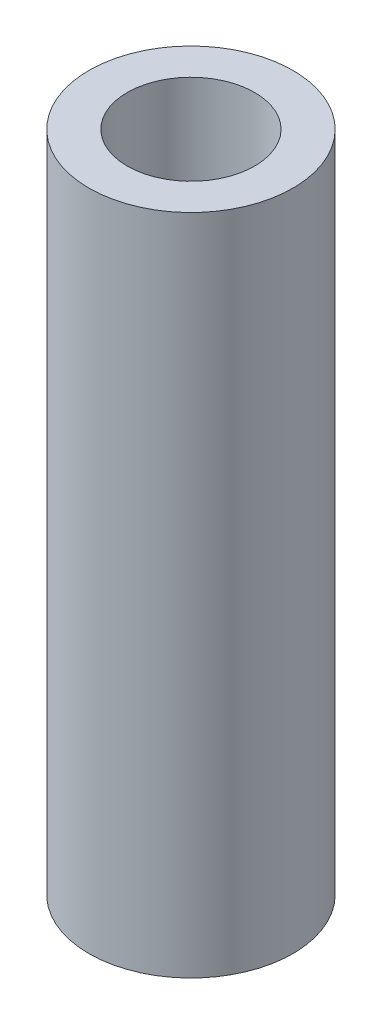
ISO-10303-21;
HEADER;
FILE_DESCRIPTION(('STEP AP214'),'2;1');
FILE_NAME('part.step','',(''),(''),'','','');
FILE_SCHEMA(('AUTOMOTIVE_DESIGN { 1 0 10303 214 1 1 1 1 }'));
ENDSEC;
DATA;
#1=APPLICATION_CONTEXT('core data for automotive mechanical design processes');
#2=APPLICATION_PROTOCOL_DEFINITION('international standard','automotive_design',2000,#1);
#3=PRODUCT_CONTEXT('',#1,'mechanical');
#4=PRODUCT('Part','Part','',(#3));
#5=PRODUCT_RELATED_PRODUCT_CATEGORY('part','',(#4));
#6=PRODUCT_DEFINITION_FORMATION('','',#4);
#7=PRODUCT_DEFINITION_CONTEXT('part definition',#1,'design');
#8=PRODUCT_DEFINITION('design','',#6,#7);
#9=PRODUCT_DEFINITION_SHAPE('','',#8);
#10=(LENGTH_UNIT() NAMED_UNIT(*) SI_UNIT(.MILLI.,.METRE.));
#11=(NAMED_UNIT(*) PLANE_ANGLE_UNIT() SI_UNIT($,.RADIAN.));
#12=(NAMED_UNIT(*) SI_UNIT($,.STERADIAN.) SOLID_ANGLE_UNIT());
#13=UNCERTAINTY_MEASURE_WITH_UNIT(LENGTH_MEASURE(1.E-05),#10,'distance_accuracy_value','');
#14=(GEOMETRIC_REPRESENTATION_CONTEXT(3) GLOBAL_UNCERTAINTY_ASSIGNED_CONTEXT((#13)) GLOBAL_UNIT_ASSIGNED_CONTEXT((#10,
#11,#12)) REPRESENTATION_CONTEXT('',''));
#15=CARTESIAN_POINT('',(0.,0.,0.));
#16=DIRECTION('',(0.,0.,1.));
#17=DIRECTION('',(1.,0.,0.));
#18=AXIS2_PLACEMENT_3D('',#15,#16,#17);
#19=CARTESIAN_POINT('',(0.,26.,0.));
#20=DIRECTION('',(0.,1.,0.));
#21=DIRECTION('',(0.,0.,1.));
#22=AXIS2_PLACEMENT_3D('',#19,#20,#21);
#23=PLANE('',#22);
#24=CARTESIAN_POINT('',(0.,26.,0.));
#25=DIRECTION('',(0.,1.,0.));
#26=DIRECTION('',(0.,0.,1.));
#27=AXIS2_PLACEMENT_3D('',#24,#25,#26);
#28=CIRCLE('',#27,4.);
#29=CARTESIAN_POINT('',(0.,26.,4.));
#30=VERTEX_POINT('',#29);
#31=EDGE_CURVE('E10',#30,#30,#28,.T.);
#32=ORIENTED_EDGE('',*,*,#31,.T.);
#33=EDGE_LOOP('',(#32));
#34=FACE_BOUND('',#33,.T.);
#35=CARTESIAN_POINT('',(0.,26.,0.));
#36=DIRECTION('',(0.,1.,0.));
#37=DIRECTION('',(0.,0.,1.));
#38=AXIS2_PLACEMENT_3D('',#35,#36,#37);
#39=CIRCLE('',#38,2.5);
#40=CARTESIAN_POINT('',(0.,26.,2.5));
#41=VERTEX_POINT('',#40);
#42=EDGE_CURVE('E42',#41,#41,#39,.T.);
#43=ORIENTED_EDGE('',*,*,#42,.F.);
#44=EDGE_LOOP('',(#43));
#45=FACE_BOUND('',#44,.T.);
#46=ADVANCED_FACE('F31',(#34,#45),#23,.T.);
#47=CARTESIAN_POINT('',(0.,0.,0.));
#48=DIRECTION('',(0.,1.,0.));
#49=DIRECTION('',(0.,0.,1.));
#50=AXIS2_PLACEMENT_3D('',#47,#48,#49);
#51=PLANE('',#50);
#52=CARTESIAN_POINT('',(0.,0.,0.));
#53=DIRECTION('',(0.,1.,0.));
#54=DIRECTION('',(0.,0.,1.));
#55=AXIS2_PLACEMENT_3D('',#52,#53,#54);
#56=CIRCLE('',#55,4.);
#57=CARTESIAN_POINT('',(0.,0.,4.));
#58=VERTEX_POINT('',#57);
#59=EDGE_CURVE('E35',#58,#58,#56,.T.);
#60=ORIENTED_EDGE('',*,*,#59,.F.);
#61=EDGE_LOOP('',(#60));
#62=FACE_BOUND('',#61,.T.);
#63=CARTESIAN_POINT('',(0.,0.,0.));
#64=DIRECTION('',(0.,1.,0.));
#65=DIRECTION('',(0.,0.,1.));
#66=AXIS2_PLACEMENT_3D('',#63,#64,#65);
#67=CIRCLE('',#66,2.5);
#68=CARTESIAN_POINT('',(0.,0.,2.5));
#69=VERTEX_POINT('',#68);
#70=EDGE_CURVE('E44',#69,#69,#67,.T.);
#71=ORIENTED_EDGE('',*,*,#70,.T.);
#72=EDGE_LOOP('',(#71));
#73=FACE_BOUND('',#72,.T.);
#74=ADVANCED_FACE('F54',(#62,#73),#51,.F.);
#75=CARTESIAN_POINT('',(0.,26.,0.));
#76=DIRECTION('',(0.,-1.,0.));
#77=DIRECTION('',(0.,0.,-1.));
#78=AXIS2_PLACEMENT_3D('',#75,#76,#77);
#79=CYLINDRICAL_SURFACE('',#78,4.);
#80=ORIENTED_EDGE('',*,*,#31,.F.);
#81=EDGE_LOOP('',(#80));
#82=FACE_BOUND('',#81,.T.);
#83=ORIENTED_EDGE('',*,*,#59,.T.);
#84=EDGE_LOOP('',(#83));
#85=FACE_BOUND('',#84,.T.);
#86=ADVANCED_FACE('F33',(#82,#85),#79,.T.);
#87=CARTESIAN_POINT('',(0.,26.,0.));
#88=DIRECTION('',(0.,-1.,0.));
#89=DIRECTION('',(0.,0.,-1.));
#90=AXIS2_PLACEMENT_3D('',#87,#88,#89);
#91=CYLINDRICAL_SURFACE('',#90,2.5);
#92=ORIENTED_EDGE('',*,*,#42,.T.);
#93=EDGE_LOOP('',(#92));
#94=FACE_BOUND('',#93,.T.);
#95=ORIENTED_EDGE('',*,*,#70,.F.);
#96=EDGE_LOOP('',(#95));
#97=FACE_BOUND('',#96,.T.);
#98=ADVANCED_FACE('F50',(#94,#97),#91,.F.);
#99=CLOSED_SHELL('',(#46,#74,#86,#98));
#100=MANIFOLD_SOLID_BREP('B2',#99);
#101=ADVANCED_BREP_SHAPE_REPRESENTATION('',(#18,#100),#14);
#102=SHAPE_DEFINITION_REPRESENTATION(#9,#101);
ENDSEC;
END-ISO-10303-21;
